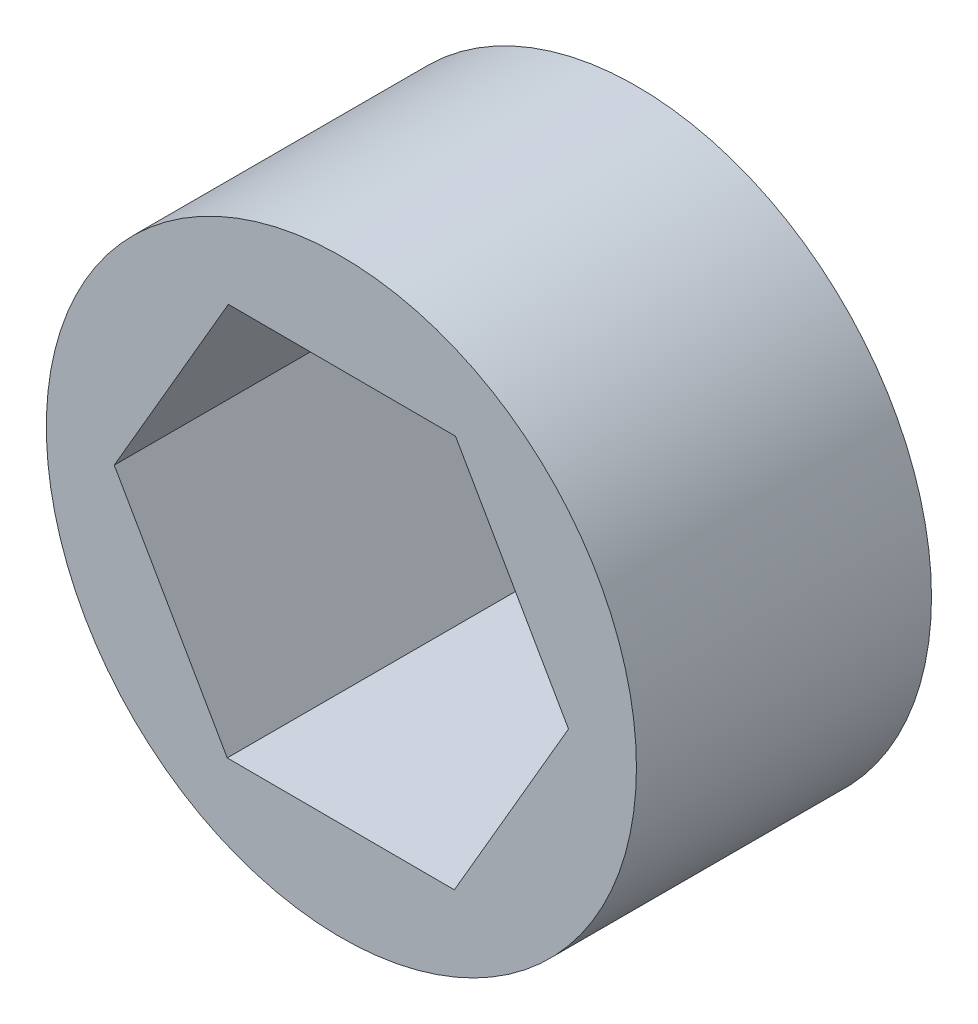
ISO-10303-21;
HEADER;
FILE_DESCRIPTION(('STEP AP214'),'2;1');
FILE_NAME('part.step','',(''),(''),'','','');
FILE_SCHEMA(('AUTOMOTIVE_DESIGN { 1 0 10303 214 1 1 1 1 }'));
ENDSEC;
DATA;
#1=APPLICATION_CONTEXT('core data for automotive mechanical design processes');
#2=APPLICATION_PROTOCOL_DEFINITION('international standard','automotive_design',2000,#1);
#3=PRODUCT_CONTEXT('',#1,'mechanical');
#4=PRODUCT('Part','Part','',(#3));
#5=PRODUCT_RELATED_PRODUCT_CATEGORY('part','',(#4));
#6=PRODUCT_DEFINITION_FORMATION('','',#4);
#7=PRODUCT_DEFINITION_CONTEXT('part definition',#1,'design');
#8=PRODUCT_DEFINITION('design','',#6,#7);
#9=PRODUCT_DEFINITION_SHAPE('','',#8);
#10=(LENGTH_UNIT() NAMED_UNIT(*) SI_UNIT(.MILLI.,.METRE.));
#11=(NAMED_UNIT(*) PLANE_ANGLE_UNIT() SI_UNIT($,.RADIAN.));
#12=(NAMED_UNIT(*) SI_UNIT($,.STERADIAN.) SOLID_ANGLE_UNIT());
#13=UNCERTAINTY_MEASURE_WITH_UNIT(LENGTH_MEASURE(1.E-05),#10,'distance_accuracy_value','');
#14=(GEOMETRIC_REPRESENTATION_CONTEXT(3) GLOBAL_UNCERTAINTY_ASSIGNED_CONTEXT((#13)) GLOBAL_UNIT_ASSIGNED_CONTEXT((#10,
#11,#12)) REPRESENTATION_CONTEXT('',''));
#15=CARTESIAN_POINT('',(0.,0.,0.));
#16=DIRECTION('',(0.,0.,1.));
#17=DIRECTION('',(1.,0.,0.));
#18=AXIS2_PLACEMENT_3D('',#15,#16,#17);
#19=CARTESIAN_POINT('',(0.,0.,9.525));
#20=DIRECTION('',(0.,0.,1.));
#21=DIRECTION('',(1.,0.,0.));
#22=AXIS2_PLACEMENT_3D('',#19,#20,#21);
#23=PLANE('',#22);
#24=CARTESIAN_POINT('',(0.,0.,9.525));
#25=DIRECTION('',(0.,0.,1.));
#26=DIRECTION('',(1.,0.,0.));
#27=AXIS2_PLACEMENT_3D('',#24,#25,#26);
#28=CIRCLE('',#27,9.525);
#29=CARTESIAN_POINT('',(9.525,0.,9.525));
#30=VERTEX_POINT('',#29);
#31=EDGE_CURVE('E11',#30,#30,#28,.T.);
#32=ORIENTED_EDGE('',*,*,#31,.T.);
#33=EDGE_LOOP('',(#32));
#34=FACE_BOUND('',#33,.T.);
#35=DIRECTION('',(0.502611333572125,0.864512491156056,0.));
#36=VECTOR('',#35,1.);
#37=CARTESIAN_POINT('',(3.64699361036975,-6.36103536692381,9.525));
#38=LINE('',#37,#36);
#39=CARTESIAN_POINT('',(3.64699361036975,-6.36103536692381,9.525));
#40=VERTEX_POINT('',#39);
#41=CARTESIAN_POINT('',(7.33231502731217,-0.0221285694421737,9.525));
#42=VERTEX_POINT('',#41);
#43=EDGE_CURVE('E100',#40,#42,#38,.T.);
#44=ORIENTED_EDGE('',*,*,#43,.F.);
#45=DIRECTION('',(0.999995446016177,-0.00301793752540637,0.));
#46=VECTOR('',#45,1.);
#47=CARTESIAN_POINT('',(-3.68532141694241,-6.33890679748164,9.525));
#48=LINE('',#47,#46);
#49=CARTESIAN_POINT('',(-3.68532141694241,-6.33890679748164,9.525));
#50=VERTEX_POINT('',#49);
#51=EDGE_CURVE('E92',#50,#40,#48,.T.);
#52=ORIENTED_EDGE('',*,*,#51,.F.);
#53=DIRECTION('',(0.497384112444053,-0.867530428681462,0.));
#54=VECTOR('',#53,1.);
#55=CARTESIAN_POINT('',(-7.33231502731217,0.022128569442172,9.525));
#56=LINE('',#55,#54);
#57=CARTESIAN_POINT('',(-7.33231502731217,0.022128569442172,9.525));
#58=VERTEX_POINT('',#57);
#59=EDGE_CURVE('E120',#58,#50,#56,.T.);
#60=ORIENTED_EDGE('',*,*,#59,.F.);
#61=DIRECTION('',(-0.502611333572125,-0.864512491156056,0.));
#62=VECTOR('',#61,1.);
#63=CARTESIAN_POINT('',(-3.64699361036976,6.36103536692381,9.525));
#64=LINE('',#63,#62);
#65=CARTESIAN_POINT('',(-3.64699361036976,6.36103536692381,9.525));
#66=VERTEX_POINT('',#65);
#67=EDGE_CURVE('E118',#66,#58,#64,.T.);
#68=ORIENTED_EDGE('',*,*,#67,.F.);
#69=DIRECTION('',(-0.999995446016177,0.00301793752540602,0.));
#70=VECTOR('',#69,1.);
#71=CARTESIAN_POINT('',(3.68532141694241,6.33890679748164,9.525));
#72=LINE('',#71,#70);
#73=CARTESIAN_POINT('',(3.68532141694241,6.33890679748164,9.525));
#74=VERTEX_POINT('',#73);
#75=EDGE_CURVE('E114',#74,#66,#72,.T.);
#76=ORIENTED_EDGE('',*,*,#75,.F.);
#77=DIRECTION('',(-0.497384112444053,0.867530428681462,0.));
#78=VECTOR('',#77,1.);
#79=CARTESIAN_POINT('',(7.33231502731217,-0.0221285694421737,9.525));
#80=LINE('',#79,#78);
#81=EDGE_CURVE('E112',#42,#74,#80,.T.);
#82=ORIENTED_EDGE('',*,*,#81,.F.);
#83=EDGE_LOOP('',(#44,#52,#60,#68,#76,#82));
#84=FACE_BOUND('',#83,.T.);
#85=ADVANCED_FACE('F39',(#34,#84),#23,.T.);
#86=CARTESIAN_POINT('',(0.,0.,0.));
#87=DIRECTION('',(0.,0.,1.));
#88=DIRECTION('',(1.,0.,0.));
#89=AXIS2_PLACEMENT_3D('',#86,#87,#88);
#90=PLANE('',#89);
#91=CARTESIAN_POINT('',(0.,0.,0.));
#92=DIRECTION('',(0.,0.,1.));
#93=DIRECTION('',(1.,0.,0.));
#94=AXIS2_PLACEMENT_3D('',#91,#92,#93);
#95=CIRCLE('',#94,9.525);
#96=CARTESIAN_POINT('',(9.525,0.,0.));
#97=VERTEX_POINT('',#96);
#98=EDGE_CURVE('E43',#97,#97,#95,.T.);
#99=ORIENTED_EDGE('',*,*,#98,.F.);
#100=EDGE_LOOP('',(#99));
#101=FACE_BOUND('',#100,.T.);
#102=DIRECTION('',(0.999995446016177,-0.00301793752540637,0.));
#103=VECTOR('',#102,1.);
#104=CARTESIAN_POINT('',(-3.68532141694241,-6.33890679748164,0.));
#105=LINE('',#104,#103);
#106=CARTESIAN_POINT('',(-3.68532141694241,-6.33890679748164,0.));
#107=VERTEX_POINT('',#106);
#108=CARTESIAN_POINT('',(3.64699361036975,-6.36103536692381,0.));
#109=VERTEX_POINT('',#108);
#110=EDGE_CURVE('E62',#107,#109,#105,.T.);
#111=ORIENTED_EDGE('',*,*,#110,.T.);
#112=DIRECTION('',(0.502611333572125,0.864512491156056,0.));
#113=VECTOR('',#112,1.);
#114=CARTESIAN_POINT('',(3.64699361036975,-6.36103536692381,0.));
#115=LINE('',#114,#113);
#116=CARTESIAN_POINT('',(7.33231502731217,-0.0221285694421737,0.));
#117=VERTEX_POINT('',#116);
#118=EDGE_CURVE('E107',#109,#117,#115,.T.);
#119=ORIENTED_EDGE('',*,*,#118,.T.);
#120=DIRECTION('',(-0.497384112444053,0.867530428681462,0.));
#121=VECTOR('',#120,1.);
#122=CARTESIAN_POINT('',(7.33231502731217,-0.0221285694421737,0.));
#123=LINE('',#122,#121);
#124=CARTESIAN_POINT('',(3.68532141694241,6.33890679748164,0.));
#125=VERTEX_POINT('',#124);
#126=EDGE_CURVE('E124',#117,#125,#123,.T.);
#127=ORIENTED_EDGE('',*,*,#126,.T.);
#128=DIRECTION('',(-0.999995446016177,0.00301793752540602,0.));
#129=VECTOR('',#128,1.);
#130=CARTESIAN_POINT('',(3.68532141694241,6.33890679748164,0.));
#131=LINE('',#130,#129);
#132=CARTESIAN_POINT('',(-3.64699361036976,6.36103536692381,0.));
#133=VERTEX_POINT('',#132);
#134=EDGE_CURVE('E127',#125,#133,#131,.T.);
#135=ORIENTED_EDGE('',*,*,#134,.T.);
#136=DIRECTION('',(-0.502611333572125,-0.864512491156056,0.));
#137=VECTOR('',#136,1.);
#138=CARTESIAN_POINT('',(-3.64699361036976,6.36103536692381,0.));
#139=LINE('',#138,#137);
#140=CARTESIAN_POINT('',(-7.33231502731217,0.022128569442172,0.));
#141=VERTEX_POINT('',#140);
#142=EDGE_CURVE('E130',#133,#141,#139,.T.);
#143=ORIENTED_EDGE('',*,*,#142,.T.);
#144=DIRECTION('',(0.497384112444053,-0.867530428681462,0.));
#145=VECTOR('',#144,1.);
#146=CARTESIAN_POINT('',(-7.33231502731217,0.022128569442172,0.));
#147=LINE('',#146,#145);
#148=EDGE_CURVE('E101',#141,#107,#147,.T.);
#149=ORIENTED_EDGE('',*,*,#148,.T.);
#150=EDGE_LOOP('',(#111,#119,#127,#135,#143,#149));
#151=FACE_BOUND('',#150,.T.);
#152=ADVANCED_FACE('F147',(#101,#151),#90,.F.);
#153=CARTESIAN_POINT('',(0.,0.,9.525));
#154=DIRECTION('',(0.,0.,-1.));
#155=DIRECTION('',(-1.,0.,0.));
#156=AXIS2_PLACEMENT_3D('',#153,#154,#155);
#157=CYLINDRICAL_SURFACE('',#156,9.525);
#158=ORIENTED_EDGE('',*,*,#31,.F.);
#159=EDGE_LOOP('',(#158));
#160=FACE_BOUND('',#159,.T.);
#161=ORIENTED_EDGE('',*,*,#98,.T.);
#162=EDGE_LOOP('',(#161));
#163=FACE_BOUND('',#162,.T.);
#164=ADVANCED_FACE('F41',(#160,#163),#157,.T.);
#165=CARTESIAN_POINT('',(-3.68532141694241,-6.33890679748164,9.525));
#166=DIRECTION('',(0.00301793752540637,0.999995446016177,0.));
#167=DIRECTION('',(-0.999995446016177,0.00301793752540637,0.));
#168=AXIS2_PLACEMENT_3D('',#165,#166,#167);
#169=PLANE('',#168);
#170=ORIENTED_EDGE('',*,*,#110,.F.);
#171=DIRECTION('',(0.,0.,-1.));
#172=VECTOR('',#171,1.);
#173=CARTESIAN_POINT('',(-3.68532141694241,-6.33890679748164,9.525));
#174=LINE('',#173,#172);
#175=EDGE_CURVE('E96',#50,#107,#174,.T.);
#176=ORIENTED_EDGE('',*,*,#175,.F.);
#177=ORIENTED_EDGE('',*,*,#51,.T.);
#178=DIRECTION('',(0.,0.,-1.));
#179=VECTOR('',#178,1.);
#180=CARTESIAN_POINT('',(3.64699361036975,-6.36103536692381,9.525));
#181=LINE('',#180,#179);
#182=EDGE_CURVE('E95',#40,#109,#181,.T.);
#183=ORIENTED_EDGE('',*,*,#182,.T.);
#184=EDGE_LOOP('',(#170,#176,#177,#183));
#185=FACE_BOUND('',#184,.T.);
#186=ADVANCED_FACE('F94',(#185),#169,.T.);
#187=CARTESIAN_POINT('',(3.64699361036975,-6.36103536692381,9.525));
#188=DIRECTION('',(-0.864512491156056,0.502611333572125,0.));
#189=DIRECTION('',(-0.502611333572125,-0.864512491156056,0.));
#190=AXIS2_PLACEMENT_3D('',#187,#188,#189);
#191=PLANE('',#190);
#192=ORIENTED_EDGE('',*,*,#118,.F.);
#193=ORIENTED_EDGE('',*,*,#182,.F.);
#194=ORIENTED_EDGE('',*,*,#43,.T.);
#195=DIRECTION('',(0.,0.,-1.));
#196=VECTOR('',#195,1.);
#197=CARTESIAN_POINT('',(7.33231502731217,-0.0221285694421737,9.525));
#198=LINE('',#197,#196);
#199=EDGE_CURVE('E108',#42,#117,#198,.T.);
#200=ORIENTED_EDGE('',*,*,#199,.T.);
#201=EDGE_LOOP('',(#192,#193,#194,#200));
#202=FACE_BOUND('',#201,.T.);
#203=ADVANCED_FACE('F104',(#202),#191,.T.);
#204=CARTESIAN_POINT('',(7.33231502731217,-0.0221285694421737,9.525));
#205=DIRECTION('',(-0.867530428681463,-0.497384112444053,0.));
#206=DIRECTION('',(0.497384112444053,-0.867530428681462,0.));
#207=AXIS2_PLACEMENT_3D('',#204,#205,#206);
#208=PLANE('',#207);
#209=ORIENTED_EDGE('',*,*,#126,.F.);
#210=ORIENTED_EDGE('',*,*,#199,.F.);
#211=ORIENTED_EDGE('',*,*,#81,.T.);
#212=DIRECTION('',(0.,0.,-1.));
#213=VECTOR('',#212,1.);
#214=CARTESIAN_POINT('',(3.68532141694241,6.33890679748164,9.525));
#215=LINE('',#214,#213);
#216=EDGE_CURVE('E139',#74,#125,#215,.T.);
#217=ORIENTED_EDGE('',*,*,#216,.T.);
#218=EDGE_LOOP('',(#209,#210,#211,#217));
#219=FACE_BOUND('',#218,.T.);
#220=ADVANCED_FACE('F143',(#219),#208,.T.);
#221=CARTESIAN_POINT('',(3.68532141694241,6.33890679748164,9.525));
#222=DIRECTION('',(-0.00301793752540602,-0.999995446016177,0.));
#223=DIRECTION('',(0.999995446016177,-0.00301793752540602,0.));
#224=AXIS2_PLACEMENT_3D('',#221,#222,#223);
#225=PLANE('',#224);
#226=ORIENTED_EDGE('',*,*,#134,.F.);
#227=ORIENTED_EDGE('',*,*,#216,.F.);
#228=ORIENTED_EDGE('',*,*,#75,.T.);
#229=DIRECTION('',(0.,0.,-1.));
#230=VECTOR('',#229,1.);
#231=CARTESIAN_POINT('',(-3.64699361036976,6.36103536692381,9.525));
#232=LINE('',#231,#230);
#233=EDGE_CURVE('E137',#66,#133,#232,.T.);
#234=ORIENTED_EDGE('',*,*,#233,.T.);
#235=EDGE_LOOP('',(#226,#227,#228,#234));
#236=FACE_BOUND('',#235,.T.);
#237=ADVANCED_FACE('F155',(#236),#225,.T.);
#238=CARTESIAN_POINT('',(-3.64699361036976,6.36103536692381,9.525));
#239=DIRECTION('',(0.864512491156056,-0.502611333572125,0.));
#240=DIRECTION('',(0.502611333572125,0.864512491156057,0.));
#241=AXIS2_PLACEMENT_3D('',#238,#239,#240);
#242=PLANE('',#241);
#243=ORIENTED_EDGE('',*,*,#142,.F.);
#244=ORIENTED_EDGE('',*,*,#233,.F.);
#245=ORIENTED_EDGE('',*,*,#67,.T.);
#246=DIRECTION('',(0.,0.,-1.));
#247=VECTOR('',#246,1.);
#248=CARTESIAN_POINT('',(-7.33231502731217,0.022128569442172,9.525));
#249=LINE('',#248,#247);
#250=EDGE_CURVE('E54',#58,#141,#249,.T.);
#251=ORIENTED_EDGE('',*,*,#250,.T.);
#252=EDGE_LOOP('',(#243,#244,#245,#251));
#253=FACE_BOUND('',#252,.T.);
#254=ADVANCED_FACE('F153',(#253),#242,.T.);
#255=CARTESIAN_POINT('',(-7.33231502731217,0.022128569442172,9.525));
#256=DIRECTION('',(0.867530428681463,0.497384112444053,0.));
#257=DIRECTION('',(-0.497384112444053,0.867530428681462,0.));
#258=AXIS2_PLACEMENT_3D('',#255,#256,#257);
#259=PLANE('',#258);
#260=ORIENTED_EDGE('',*,*,#148,.F.);
#261=ORIENTED_EDGE('',*,*,#250,.F.);
#262=ORIENTED_EDGE('',*,*,#59,.T.);
#263=ORIENTED_EDGE('',*,*,#175,.T.);
#264=EDGE_LOOP('',(#260,#261,#262,#263));
#265=FACE_BOUND('',#264,.T.);
#266=ADVANCED_FACE('F149',(#265),#259,.T.);
#267=CLOSED_SHELL('',(#85,#152,#164,#186,#203,#220,#237,#254,#266));
#268=MANIFOLD_SOLID_BREP('B2',#267);
#269=ADVANCED_BREP_SHAPE_REPRESENTATION('',(#18,#268),#14);
#270=SHAPE_DEFINITION_REPRESENTATION(#9,#269);
ENDSEC;
END-ISO-10303-21;
